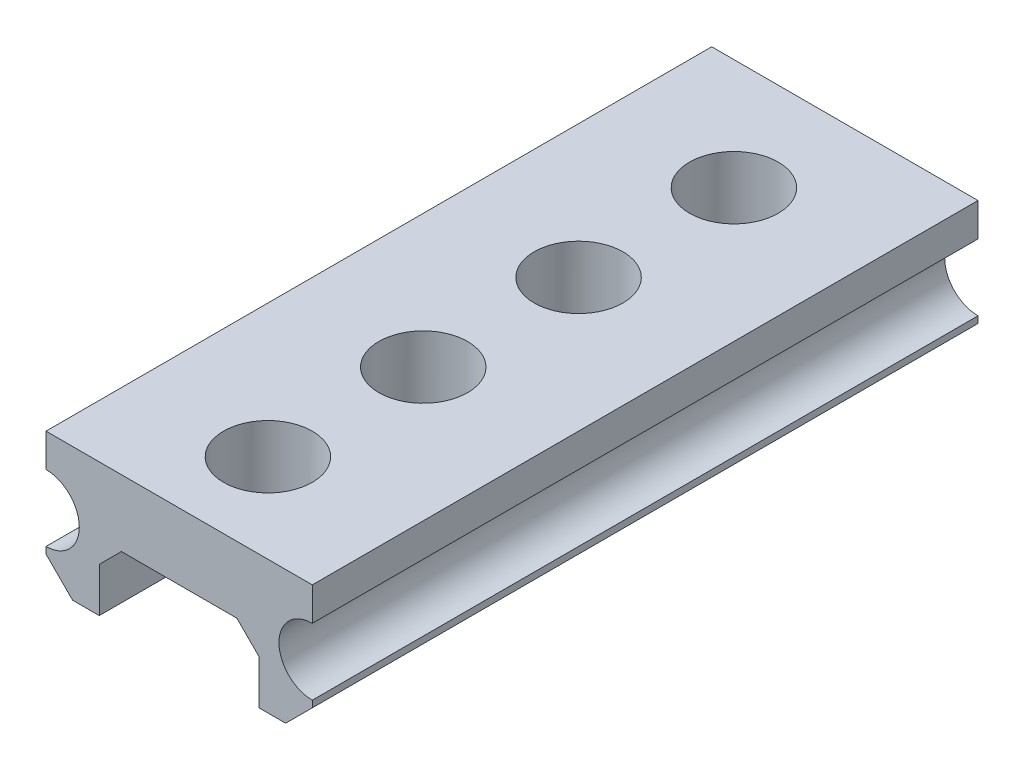
ISO-10303-21;
HEADER;
FILE_DESCRIPTION(('STEP AP214'),'2;1');
FILE_NAME('part.step','',(''),(''),'','','');
FILE_SCHEMA(('AUTOMOTIVE_DESIGN { 1 0 10303 214 1 1 1 1 }'));
ENDSEC;
DATA;
#1=APPLICATION_CONTEXT('core data for automotive mechanical design processes');
#2=APPLICATION_PROTOCOL_DEFINITION('international standard','automotive_design',2000,#1);
#3=PRODUCT_CONTEXT('',#1,'mechanical');
#4=PRODUCT('Part','Part','',(#3));
#5=PRODUCT_RELATED_PRODUCT_CATEGORY('part','',(#4));
#6=PRODUCT_DEFINITION_FORMATION('','',#4);
#7=PRODUCT_DEFINITION_CONTEXT('part definition',#1,'design');
#8=PRODUCT_DEFINITION('design','',#6,#7);
#9=PRODUCT_DEFINITION_SHAPE('','',#8);
#10=(LENGTH_UNIT() NAMED_UNIT(*) SI_UNIT(.MILLI.,.METRE.));
#11=(NAMED_UNIT(*) PLANE_ANGLE_UNIT() SI_UNIT($,.RADIAN.));
#12=(NAMED_UNIT(*) SI_UNIT($,.STERADIAN.) SOLID_ANGLE_UNIT());
#13=UNCERTAINTY_MEASURE_WITH_UNIT(LENGTH_MEASURE(1.E-05),#10,'distance_accuracy_value','');
#14=(GEOMETRIC_REPRESENTATION_CONTEXT(3) GLOBAL_UNCERTAINTY_ASSIGNED_CONTEXT((#13)) GLOBAL_UNIT_ASSIGNED_CONTEXT((#10,
#11,#12)) REPRESENTATION_CONTEXT('',''));
#15=CARTESIAN_POINT('',(0.,0.,0.));
#16=DIRECTION('',(0.,0.,1.));
#17=DIRECTION('',(1.,0.,0.));
#18=AXIS2_PLACEMENT_3D('',#15,#16,#17);
#19=CARTESIAN_POINT('',(-3.,-1.5,15.));
#20=DIRECTION('',(0.,1.,0.));
#21=DIRECTION('',(0.,0.,1.));
#22=AXIS2_PLACEMENT_3D('',#19,#20,#21);
#23=PLANE('',#22);
#24=DIRECTION('',(1.,0.,0.));
#25=VECTOR('',#24,1.);
#26=CARTESIAN_POINT('',(-3.,-1.5,15.));
#27=LINE('',#26,#25);
#28=CARTESIAN_POINT('',(1.8,-1.5,15.));
#29=VERTEX_POINT('',#28);
#30=CARTESIAN_POINT('',(2.4,-1.5,15.));
#31=VERTEX_POINT('',#30);
#32=EDGE_CURVE('E161',#29,#31,#27,.T.);
#33=ORIENTED_EDGE('',*,*,#32,.F.);
#34=DIRECTION('',(0.,0.,-1.));
#35=VECTOR('',#34,1.);
#36=CARTESIAN_POINT('',(1.8,-1.5,20.));
#37=LINE('',#36,#35);
#38=CARTESIAN_POINT('',(1.8,-1.5,0.));
#39=VERTEX_POINT('',#38);
#40=EDGE_CURVE('E148',#29,#39,#37,.T.);
#41=ORIENTED_EDGE('',*,*,#40,.T.);
#42=DIRECTION('',(1.,0.,0.));
#43=VECTOR('',#42,1.);
#44=CARTESIAN_POINT('',(-3.,-1.5,0.));
#45=LINE('',#44,#43);
#46=CARTESIAN_POINT('',(2.4,-1.5,0.));
#47=VERTEX_POINT('',#46);
#48=EDGE_CURVE('E159',#39,#47,#45,.T.);
#49=ORIENTED_EDGE('',*,*,#48,.T.);
#50=DIRECTION('',(0.,0.,1.));
#51=VECTOR('',#50,1.);
#52=CARTESIAN_POINT('',(2.4,-1.5,15.));
#53=LINE('',#52,#51);
#54=EDGE_CURVE('E191',#47,#31,#53,.T.);
#55=ORIENTED_EDGE('',*,*,#54,.T.);
#56=EDGE_LOOP('',(#33,#41,#49,#55));
#57=FACE_BOUND('',#56,.T.);
#58=ADVANCED_FACE('F32',(#57),#23,.F.);
#59=CARTESIAN_POINT('',(0.,-18.5,13.));
#60=DIRECTION('',(0.,1.,0.));
#61=DIRECTION('',(0.,0.,1.));
#62=AXIS2_PLACEMENT_3D('',#59,#60,#61);
#63=CYLINDRICAL_SURFACE('',#62,1.);
#64=CARTESIAN_POINT('',(0.,0.,13.));
#65=DIRECTION('',(0.,1.,0.));
#66=DIRECTION('',(-1.,0.,0.));
#67=AXIS2_PLACEMENT_3D('',#64,#65,#66);
#68=CIRCLE('',#67,1.);
#69=CARTESIAN_POINT('',(-1.,0.,13.));
#70=VERTEX_POINT('',#69);
#71=EDGE_CURVE('E256',#70,#70,#68,.F.);
#72=ORIENTED_EDGE('',*,*,#71,.T.);
#73=EDGE_LOOP('',(#72));
#74=FACE_BOUND('',#73,.T.);
#75=CARTESIAN_POINT('',(0.,1.5,13.));
#76=DIRECTION('',(0.,1.,0.));
#77=DIRECTION('',(0.,0.,1.));
#78=AXIS2_PLACEMENT_3D('',#75,#76,#77);
#79=CIRCLE('',#78,1.);
#80=CARTESIAN_POINT('',(0.,1.5,14.));
#81=VERTEX_POINT('',#80);
#82=EDGE_CURVE('E211',#81,#81,#79,.T.);
#83=ORIENTED_EDGE('',*,*,#82,.T.);
#84=EDGE_LOOP('',(#83));
#85=FACE_BOUND('',#84,.T.);
#86=ADVANCED_FACE('F323',(#74,#85),#63,.F.);
#87=CARTESIAN_POINT('',(0.,-18.5,9.5));
#88=DIRECTION('',(0.,1.,0.));
#89=DIRECTION('',(0.,0.,1.));
#90=AXIS2_PLACEMENT_3D('',#87,#88,#89);
#91=CYLINDRICAL_SURFACE('',#90,1.);
#92=CARTESIAN_POINT('',(0.,0.,9.5));
#93=DIRECTION('',(0.,1.,0.));
#94=DIRECTION('',(-1.,0.,0.));
#95=AXIS2_PLACEMENT_3D('',#92,#93,#94);
#96=CIRCLE('',#95,1.);
#97=CARTESIAN_POINT('',(-1.,0.,9.5));
#98=VERTEX_POINT('',#97);
#99=EDGE_CURVE('E253',#98,#98,#96,.F.);
#100=ORIENTED_EDGE('',*,*,#99,.T.);
#101=EDGE_LOOP('',(#100));
#102=FACE_BOUND('',#101,.T.);
#103=CARTESIAN_POINT('',(0.,1.5,9.5));
#104=DIRECTION('',(0.,1.,0.));
#105=DIRECTION('',(0.,0.,1.));
#106=AXIS2_PLACEMENT_3D('',#103,#104,#105);
#107=CIRCLE('',#106,1.);
#108=CARTESIAN_POINT('',(0.,1.5,10.5));
#109=VERTEX_POINT('',#108);
#110=EDGE_CURVE('E208',#109,#109,#107,.T.);
#111=ORIENTED_EDGE('',*,*,#110,.T.);
#112=EDGE_LOOP('',(#111));
#113=FACE_BOUND('',#112,.T.);
#114=ADVANCED_FACE('F328',(#102,#113),#91,.F.);
#115=CARTESIAN_POINT('',(3.,1.5,15.));
#116=DIRECTION('',(-1.,0.,0.));
#117=DIRECTION('',(0.,-1.,0.));
#118=AXIS2_PLACEMENT_3D('',#115,#116,#117);
#119=PLANE('',#118);
#120=DIRECTION('',(0.,1.,0.));
#121=VECTOR('',#120,1.);
#122=CARTESIAN_POINT('',(3.,1.5,15.));
#123=LINE('',#122,#121);
#124=CARTESIAN_POINT('',(3.,-0.900000000000004,15.));
#125=VERTEX_POINT('',#124);
#126=CARTESIAN_POINT('',(3.,-0.75,15.));
#127=VERTEX_POINT('',#126);
#128=EDGE_CURVE('E283',#125,#127,#123,.T.);
#129=ORIENTED_EDGE('',*,*,#128,.F.);
#130=DIRECTION('',(0.,0.,-1.));
#131=VECTOR('',#130,1.);
#132=CARTESIAN_POINT('',(3.,-0.900000000000004,15.));
#133=LINE('',#132,#131);
#134=CARTESIAN_POINT('',(3.,-0.900000000000004,0.));
#135=VERTEX_POINT('',#134);
#136=EDGE_CURVE('E205',#125,#135,#133,.T.);
#137=ORIENTED_EDGE('',*,*,#136,.T.);
#138=DIRECTION('',(0.,1.,0.));
#139=VECTOR('',#138,1.);
#140=CARTESIAN_POINT('',(3.,1.5,0.));
#141=LINE('',#140,#139);
#142=CARTESIAN_POINT('',(3.,-0.75,0.));
#143=VERTEX_POINT('',#142);
#144=EDGE_CURVE('E293',#135,#143,#141,.T.);
#145=ORIENTED_EDGE('',*,*,#144,.T.);
#146=DIRECTION('',(0.,0.,1.));
#147=VECTOR('',#146,1.);
#148=CARTESIAN_POINT('',(3.,-0.75,-5.));
#149=LINE('',#148,#147);
#150=EDGE_CURVE('E279',#143,#127,#149,.T.);
#151=ORIENTED_EDGE('',*,*,#150,.T.);
#152=EDGE_LOOP('',(#129,#137,#145,#151));
#153=FACE_BOUND('',#152,.T.);
#154=ADVANCED_FACE('F348',(#153),#119,.F.);
#155=CARTESIAN_POINT('',(-3.,1.5,15.));
#156=DIRECTION('',(1.,0.,0.));
#157=DIRECTION('',(0.,0.,-1.));
#158=AXIS2_PLACEMENT_3D('',#155,#156,#157);
#159=PLANE('',#158);
#160=DIRECTION('',(0.,-1.,0.));
#161=VECTOR('',#160,1.);
#162=CARTESIAN_POINT('',(-3.,1.5,0.));
#163=LINE('',#162,#161);
#164=CARTESIAN_POINT('',(-3.,1.5,0.));
#165=VERTEX_POINT('',#164);
#166=CARTESIAN_POINT('',(-3.,0.75,0.));
#167=VERTEX_POINT('',#166);
#168=EDGE_CURVE('E169',#165,#167,#163,.T.);
#169=ORIENTED_EDGE('',*,*,#168,.T.);
#170=DIRECTION('',(0.,0.,1.));
#171=VECTOR('',#170,1.);
#172=CARTESIAN_POINT('',(-3.,0.75,-5.));
#173=LINE('',#172,#171);
#174=CARTESIAN_POINT('',(-3.,0.75,15.));
#175=VERTEX_POINT('',#174);
#176=EDGE_CURVE('E273',#167,#175,#173,.T.);
#177=ORIENTED_EDGE('',*,*,#176,.T.);
#178=DIRECTION('',(0.,-1.,0.));
#179=VECTOR('',#178,1.);
#180=CARTESIAN_POINT('',(-3.,1.5,15.));
#181=LINE('',#180,#179);
#182=CARTESIAN_POINT('',(-3.,1.5,15.));
#183=VERTEX_POINT('',#182);
#184=EDGE_CURVE('E288',#183,#175,#181,.T.);
#185=ORIENTED_EDGE('',*,*,#184,.F.);
#186=DIRECTION('',(0.,0.,-1.));
#187=VECTOR('',#186,1.);
#188=CARTESIAN_POINT('',(-3.,1.5,15.));
#189=LINE('',#188,#187);
#190=EDGE_CURVE('E178',#183,#165,#189,.T.);
#191=ORIENTED_EDGE('',*,*,#190,.T.);
#192=EDGE_LOOP('',(#169,#177,#185,#191));
#193=FACE_BOUND('',#192,.T.);
#194=ADVANCED_FACE('F340',(#193),#159,.F.);
#195=CARTESIAN_POINT('',(3.,0.75,15.));
#196=VERTEX_POINT('',#195);
#197=CARTESIAN_POINT('',(3.,1.5,15.));
#198=VERTEX_POINT('',#197);
#199=EDGE_CURVE('E172',#196,#198,#123,.T.);
#200=ORIENTED_EDGE('',*,*,#199,.F.);
#201=DIRECTION('',(0.,0.,1.));
#202=VECTOR('',#201,1.);
#203=CARTESIAN_POINT('',(3.,0.75,-5.));
#204=LINE('',#203,#202);
#205=CARTESIAN_POINT('',(3.,0.75,0.));
#206=VERTEX_POINT('',#205);
#207=EDGE_CURVE('E276',#196,#206,#204,.F.);
#208=ORIENTED_EDGE('',*,*,#207,.T.);
#209=CARTESIAN_POINT('',(3.,1.5,0.));
#210=VERTEX_POINT('',#209);
#211=EDGE_CURVE('E282',#206,#210,#141,.T.);
#212=ORIENTED_EDGE('',*,*,#211,.T.);
#213=DIRECTION('',(0.,0.,-1.));
#214=VECTOR('',#213,1.);
#215=CARTESIAN_POINT('',(3.,1.5,15.));
#216=LINE('',#215,#214);
#217=EDGE_CURVE('E181',#198,#210,#216,.T.);
#218=ORIENTED_EDGE('',*,*,#217,.F.);
#219=EDGE_LOOP('',(#200,#208,#212,#218));
#220=FACE_BOUND('',#219,.T.);
#221=ADVANCED_FACE('F344',(#220),#119,.F.);
#222=CARTESIAN_POINT('',(-3.,1.5,15.));
#223=DIRECTION('',(0.,-1.,0.));
#224=DIRECTION('',(0.,0.,-1.));
#225=AXIS2_PLACEMENT_3D('',#222,#223,#224);
#226=PLANE('',#225);
#227=CARTESIAN_POINT('',(0.,1.5,6.));
#228=DIRECTION('',(0.,1.,0.));
#229=DIRECTION('',(0.,0.,1.));
#230=AXIS2_PLACEMENT_3D('',#227,#228,#229);
#231=CIRCLE('',#230,1.);
#232=CARTESIAN_POINT('',(0.,1.5,7.));
#233=VERTEX_POINT('',#232);
#234=EDGE_CURVE('E236',#233,#233,#231,.T.);
#235=ORIENTED_EDGE('',*,*,#234,.F.);
#236=EDGE_LOOP('',(#235));
#237=FACE_BOUND('',#236,.T.);
#238=CARTESIAN_POINT('',(0.,1.5,2.5));
#239=DIRECTION('',(0.,1.,0.));
#240=DIRECTION('',(0.,0.,1.));
#241=AXIS2_PLACEMENT_3D('',#238,#239,#240);
#242=CIRCLE('',#241,1.);
#243=CARTESIAN_POINT('',(0.,1.5,3.5));
#244=VERTEX_POINT('',#243);
#245=EDGE_CURVE('E262',#244,#244,#242,.T.);
#246=ORIENTED_EDGE('',*,*,#245,.F.);
#247=EDGE_LOOP('',(#246));
#248=FACE_BOUND('',#247,.T.);
#249=DIRECTION('',(-1.,0.,0.));
#250=VECTOR('',#249,1.);
#251=CARTESIAN_POINT('',(-3.,1.5,0.));
#252=LINE('',#251,#250);
#253=EDGE_CURVE('E294',#210,#165,#252,.T.);
#254=ORIENTED_EDGE('',*,*,#253,.T.);
#255=ORIENTED_EDGE('',*,*,#190,.F.);
#256=DIRECTION('',(-1.,0.,0.));
#257=VECTOR('',#256,1.);
#258=CARTESIAN_POINT('',(-3.,1.5,15.));
#259=LINE('',#258,#257);
#260=EDGE_CURVE('E285',#198,#183,#259,.T.);
#261=ORIENTED_EDGE('',*,*,#260,.F.);
#262=ORIENTED_EDGE('',*,*,#217,.T.);
#263=EDGE_LOOP('',(#254,#255,#261,#262));
#264=FACE_BOUND('',#263,.T.);
#265=ORIENTED_EDGE('',*,*,#110,.F.);
#266=EDGE_LOOP('',(#265));
#267=FACE_BOUND('',#266,.T.);
#268=ORIENTED_EDGE('',*,*,#82,.F.);
#269=EDGE_LOOP('',(#268));
#270=FACE_BOUND('',#269,.T.);
#271=ADVANCED_FACE('F339',(#237,#248,#264,#267,#270),#226,.F.);
#272=CARTESIAN_POINT('',(-3.,-0.75,0.));
#273=VERTEX_POINT('',#272);
#274=CARTESIAN_POINT('',(-3.,-0.899999999999995,0.));
#275=VERTEX_POINT('',#274);
#276=EDGE_CURVE('E174',#273,#275,#163,.T.);
#277=ORIENTED_EDGE('',*,*,#276,.T.);
#278=DIRECTION('',(0.,0.,1.));
#279=VECTOR('',#278,1.);
#280=CARTESIAN_POINT('',(-3.,-0.899999999999995,15.));
#281=LINE('',#280,#279);
#282=CARTESIAN_POINT('',(-3.,-0.899999999999995,15.));
#283=VERTEX_POINT('',#282);
#284=EDGE_CURVE('E199',#275,#283,#281,.T.);
#285=ORIENTED_EDGE('',*,*,#284,.T.);
#286=CARTESIAN_POINT('',(-3.,-0.75,15.));
#287=VERTEX_POINT('',#286);
#288=EDGE_CURVE('E287',#287,#283,#181,.T.);
#289=ORIENTED_EDGE('',*,*,#288,.F.);
#290=DIRECTION('',(0.,0.,1.));
#291=VECTOR('',#290,1.);
#292=CARTESIAN_POINT('',(-3.,-0.75,-5.));
#293=LINE('',#292,#291);
#294=EDGE_CURVE('E269',#287,#273,#293,.F.);
#295=ORIENTED_EDGE('',*,*,#294,.T.);
#296=EDGE_LOOP('',(#277,#285,#289,#295));
#297=FACE_BOUND('',#296,.T.);
#298=ADVANCED_FACE('F302',(#297),#159,.F.);
#299=CARTESIAN_POINT('',(-2.4,-1.5,0.));
#300=VERTEX_POINT('',#299);
#301=CARTESIAN_POINT('',(-1.8,-1.5,0.));
#302=VERTEX_POINT('',#301);
#303=EDGE_CURVE('E168',#300,#302,#45,.T.);
#304=ORIENTED_EDGE('',*,*,#303,.T.);
#305=DIRECTION('',(0.,0.,-1.));
#306=VECTOR('',#305,1.);
#307=CARTESIAN_POINT('',(-1.8,-1.5,20.));
#308=LINE('',#307,#306);
#309=CARTESIAN_POINT('',(-1.8,-1.5,15.));
#310=VERTEX_POINT('',#309);
#311=EDGE_CURVE('E153',#310,#302,#308,.T.);
#312=ORIENTED_EDGE('',*,*,#311,.F.);
#313=CARTESIAN_POINT('',(-2.4,-1.5,15.));
#314=VERTEX_POINT('',#313);
#315=EDGE_CURVE('E182',#314,#310,#27,.T.);
#316=ORIENTED_EDGE('',*,*,#315,.F.);
#317=DIRECTION('',(0.,0.,-1.));
#318=VECTOR('',#317,1.);
#319=CARTESIAN_POINT('',(-2.4,-1.5,15.));
#320=LINE('',#319,#318);
#321=EDGE_CURVE('E193',#314,#300,#320,.T.);
#322=ORIENTED_EDGE('',*,*,#321,.T.);
#323=EDGE_LOOP('',(#304,#312,#316,#322));
#324=FACE_BOUND('',#323,.T.);
#325=ADVANCED_FACE('F313',(#324),#23,.F.);
#326=CARTESIAN_POINT('',(0.,0.,15.));
#327=DIRECTION('',(0.,0.,1.));
#328=DIRECTION('',(1.,0.,0.));
#329=AXIS2_PLACEMENT_3D('',#326,#327,#328);
#330=PLANE('',#329);
#331=DIRECTION('',(0.,1.,0.));
#332=VECTOR('',#331,1.);
#333=CARTESIAN_POINT('',(1.8,0.,15.));
#334=LINE('',#333,#332);
#335=CARTESIAN_POINT('',(1.8,-0.500000000000005,15.));
#336=VERTEX_POINT('',#335);
#337=EDGE_CURVE('E231',#29,#336,#334,.T.);
#338=ORIENTED_EDGE('',*,*,#337,.F.);
#339=ORIENTED_EDGE('',*,*,#32,.T.);
#340=DIRECTION('',(-0.70710678118655,-0.707106781186545,0.));
#341=VECTOR('',#340,1.);
#342=CARTESIAN_POINT('',(1.94999999999999,-1.95000000000001,15.));
#343=LINE('',#342,#341);
#344=EDGE_CURVE('E201',#31,#125,#343,.F.);
#345=ORIENTED_EDGE('',*,*,#344,.T.);
#346=ORIENTED_EDGE('',*,*,#128,.T.);
#347=CARTESIAN_POINT('',(3.,0.,15.));
#348=DIRECTION('',(0.,0.,1.));
#349=DIRECTION('',(1.,0.,0.));
#350=AXIS2_PLACEMENT_3D('',#347,#348,#349);
#351=CIRCLE('',#350,0.75);
#352=EDGE_CURVE('E266',#196,#127,#351,.T.);
#353=ORIENTED_EDGE('',*,*,#352,.F.);
#354=ORIENTED_EDGE('',*,*,#199,.T.);
#355=ORIENTED_EDGE('',*,*,#260,.T.);
#356=ORIENTED_EDGE('',*,*,#184,.T.);
#357=CARTESIAN_POINT('',(-3.,0.,15.));
#358=DIRECTION('',(0.,0.,1.));
#359=DIRECTION('',(1.,0.,0.));
#360=AXIS2_PLACEMENT_3D('',#357,#358,#359);
#361=CIRCLE('',#360,0.75);
#362=EDGE_CURVE('E265',#287,#175,#361,.T.);
#363=ORIENTED_EDGE('',*,*,#362,.F.);
#364=ORIENTED_EDGE('',*,*,#288,.T.);
#365=DIRECTION('',(-0.707106781186546,0.70710678118655,0.));
#366=VECTOR('',#365,1.);
#367=CARTESIAN_POINT('',(-1.95000000000001,-1.95,15.));
#368=LINE('',#367,#366);
#369=EDGE_CURVE('E203',#283,#314,#368,.F.);
#370=ORIENTED_EDGE('',*,*,#369,.T.);
#371=ORIENTED_EDGE('',*,*,#315,.T.);
#372=DIRECTION('',(0.,-1.,0.));
#373=VECTOR('',#372,1.);
#374=CARTESIAN_POINT('',(-1.8,0.,15.));
#375=LINE('',#374,#373);
#376=CARTESIAN_POINT('',(-1.8,-0.500000000000001,15.));
#377=VERTEX_POINT('',#376);
#378=EDGE_CURVE('E237',#377,#310,#375,.T.);
#379=ORIENTED_EDGE('',*,*,#378,.F.);
#380=DIRECTION('',(-0.707106781186551,-0.707106781186544,0.));
#381=VECTOR('',#380,1.);
#382=CARTESIAN_POINT('',(-1.29999999999999,0.,15.));
#383=LINE('',#382,#381);
#384=CARTESIAN_POINT('',(-1.29999999999999,0.,15.));
#385=VERTEX_POINT('',#384);
#386=EDGE_CURVE('E11',#377,#385,#383,.F.);
#387=ORIENTED_EDGE('',*,*,#386,.T.);
#388=DIRECTION('',(-1.,0.,0.));
#389=VECTOR('',#388,1.);
#390=CARTESIAN_POINT('',(0.,0.,15.));
#391=LINE('',#390,#389);
#392=CARTESIAN_POINT('',(1.3,0.,15.));
#393=VERTEX_POINT('',#392);
#394=EDGE_CURVE('E233',#393,#385,#391,.T.);
#395=ORIENTED_EDGE('',*,*,#394,.F.);
#396=DIRECTION('',(-0.707106781186544,0.707106781186551,0.));
#397=VECTOR('',#396,1.);
#398=CARTESIAN_POINT('',(1.8,-0.500000000000005,15.));
#399=LINE('',#398,#397);
#400=EDGE_CURVE('E226',#393,#336,#399,.F.);
#401=ORIENTED_EDGE('',*,*,#400,.T.);
#402=EDGE_LOOP('',(#338,#339,#345,#346,#353,#354,#355,#356,#363,#364,#370,#371,#379,#387,#395,#401));
#403=FACE_BOUND('',#402,.T.);
#404=ADVANCED_FACE('F230',(#403),#330,.T.);
#405=CARTESIAN_POINT('',(0.,0.,0.));
#406=DIRECTION('',(0.,0.,1.));
#407=DIRECTION('',(1.,0.,0.));
#408=AXIS2_PLACEMENT_3D('',#405,#406,#407);
#409=PLANE('',#408);
#410=ORIENTED_EDGE('',*,*,#48,.F.);
#411=DIRECTION('',(0.,-1.,0.));
#412=VECTOR('',#411,1.);
#413=CARTESIAN_POINT('',(1.8,0.,0.));
#414=LINE('',#413,#412);
#415=CARTESIAN_POINT('',(1.8,-0.500000000000005,0.));
#416=VERTEX_POINT('',#415);
#417=EDGE_CURVE('E144',#416,#39,#414,.T.);
#418=ORIENTED_EDGE('',*,*,#417,.F.);
#419=DIRECTION('',(0.707106781186544,-0.707106781186551,0.));
#420=VECTOR('',#419,1.);
#421=CARTESIAN_POINT('',(0.650000000000007,0.65,0.));
#422=LINE('',#421,#420);
#423=CARTESIAN_POINT('',(1.3,0.,0.));
#424=VERTEX_POINT('',#423);
#425=EDGE_CURVE('E224',#416,#424,#422,.F.);
#426=ORIENTED_EDGE('',*,*,#425,.T.);
#427=DIRECTION('',(1.,0.,0.));
#428=VECTOR('',#427,1.);
#429=CARTESIAN_POINT('',(-1.8,0.,0.));
#430=LINE('',#429,#428);
#431=CARTESIAN_POINT('',(-1.29999999999999,0.,0.));
#432=VERTEX_POINT('',#431);
#433=EDGE_CURVE('E154',#432,#424,#430,.T.);
#434=ORIENTED_EDGE('',*,*,#433,.F.);
#435=DIRECTION('',(0.707106781186551,0.707106781186544,0.));
#436=VECTOR('',#435,1.);
#437=CARTESIAN_POINT('',(-0.64999999999999,0.649999999999997,0.));
#438=LINE('',#437,#436);
#439=CARTESIAN_POINT('',(-1.8,-0.500000000000001,0.));
#440=VERTEX_POINT('',#439);
#441=EDGE_CURVE('E40',#432,#440,#438,.F.);
#442=ORIENTED_EDGE('',*,*,#441,.T.);
#443=DIRECTION('',(0.,1.,0.));
#444=VECTOR('',#443,1.);
#445=CARTESIAN_POINT('',(-1.8,-1.5,0.));
#446=LINE('',#445,#444);
#447=EDGE_CURVE('E245',#302,#440,#446,.T.);
#448=ORIENTED_EDGE('',*,*,#447,.F.);
#449=ORIENTED_EDGE('',*,*,#303,.F.);
#450=DIRECTION('',(0.707106781186546,-0.70710678118655,0.));
#451=VECTOR('',#450,1.);
#452=CARTESIAN_POINT('',(-2.4,-1.5,0.));
#453=LINE('',#452,#451);
#454=EDGE_CURVE('E197',#300,#275,#453,.F.);
#455=ORIENTED_EDGE('',*,*,#454,.T.);
#456=ORIENTED_EDGE('',*,*,#276,.F.);
#457=CARTESIAN_POINT('',(-3.,0.,0.));
#458=DIRECTION('',(0.,0.,1.));
#459=DIRECTION('',(1.,0.,0.));
#460=AXIS2_PLACEMENT_3D('',#457,#458,#459);
#461=CIRCLE('',#460,0.75);
#462=EDGE_CURVE('E185',#273,#167,#461,.T.);
#463=ORIENTED_EDGE('',*,*,#462,.T.);
#464=ORIENTED_EDGE('',*,*,#168,.F.);
#465=ORIENTED_EDGE('',*,*,#253,.F.);
#466=ORIENTED_EDGE('',*,*,#211,.F.);
#467=CARTESIAN_POINT('',(3.,0.,0.));
#468=DIRECTION('',(0.,0.,1.));
#469=DIRECTION('',(1.,0.,0.));
#470=AXIS2_PLACEMENT_3D('',#467,#468,#469);
#471=CIRCLE('',#470,0.75);
#472=EDGE_CURVE('E188',#206,#143,#471,.T.);
#473=ORIENTED_EDGE('',*,*,#472,.T.);
#474=ORIENTED_EDGE('',*,*,#144,.F.);
#475=DIRECTION('',(0.70710678118655,0.707106781186545,0.));
#476=VECTOR('',#475,1.);
#477=CARTESIAN_POINT('',(3.,-0.900000000000004,0.));
#478=LINE('',#477,#476);
#479=EDGE_CURVE('E166',#135,#47,#478,.F.);
#480=ORIENTED_EDGE('',*,*,#479,.T.);
#481=EDGE_LOOP('',(#410,#418,#426,#434,#442,#448,#449,#455,#456,#463,#464,#465,#466,#473,#474,#480));
#482=FACE_BOUND('',#481,.T.);
#483=ADVANCED_FACE('F164',(#482),#409,.F.);
#484=CARTESIAN_POINT('',(-3.,0.,-5.));
#485=DIRECTION('',(0.,0.,1.));
#486=DIRECTION('',(1.,0.,0.));
#487=AXIS2_PLACEMENT_3D('',#484,#485,#486);
#488=CYLINDRICAL_SURFACE('',#487,0.75);
#489=ORIENTED_EDGE('',*,*,#462,.F.);
#490=ORIENTED_EDGE('',*,*,#294,.F.);
#491=ORIENTED_EDGE('',*,*,#362,.T.);
#492=ORIENTED_EDGE('',*,*,#176,.F.);
#493=EDGE_LOOP('',(#489,#490,#491,#492));
#494=FACE_BOUND('',#493,.T.);
#495=ADVANCED_FACE('F361',(#494),#488,.F.);
#496=CARTESIAN_POINT('',(3.,0.,-5.));
#497=DIRECTION('',(0.,0.,1.));
#498=DIRECTION('',(1.,0.,0.));
#499=AXIS2_PLACEMENT_3D('',#496,#497,#498);
#500=CYLINDRICAL_SURFACE('',#499,0.75);
#501=ORIENTED_EDGE('',*,*,#472,.F.);
#502=ORIENTED_EDGE('',*,*,#207,.F.);
#503=ORIENTED_EDGE('',*,*,#352,.T.);
#504=ORIENTED_EDGE('',*,*,#150,.F.);
#505=EDGE_LOOP('',(#501,#502,#503,#504));
#506=FACE_BOUND('',#505,.T.);
#507=ADVANCED_FACE('F384',(#506),#500,.F.);
#508=CARTESIAN_POINT('',(-2.4,-1.5,15.));
#509=DIRECTION('',(0.70710678118655,0.707106781186546,0.));
#510=DIRECTION('',(0.,0.,-1.));
#511=AXIS2_PLACEMENT_3D('',#508,#509,#510);
#512=PLANE('',#511);
#513=ORIENTED_EDGE('',*,*,#369,.F.);
#514=ORIENTED_EDGE('',*,*,#284,.F.);
#515=ORIENTED_EDGE('',*,*,#454,.F.);
#516=ORIENTED_EDGE('',*,*,#321,.F.);
#517=EDGE_LOOP('',(#513,#514,#515,#516));
#518=FACE_BOUND('',#517,.T.);
#519=ADVANCED_FACE('F307',(#518),#512,.F.);
#520=CARTESIAN_POINT('',(3.,-0.900000000000004,15.));
#521=DIRECTION('',(-0.707106781186545,0.70710678118655,0.));
#522=DIRECTION('',(0.,0.,-1.));
#523=AXIS2_PLACEMENT_3D('',#520,#521,#522);
#524=PLANE('',#523);
#525=ORIENTED_EDGE('',*,*,#344,.F.);
#526=ORIENTED_EDGE('',*,*,#54,.F.);
#527=ORIENTED_EDGE('',*,*,#479,.F.);
#528=ORIENTED_EDGE('',*,*,#136,.F.);
#529=EDGE_LOOP('',(#525,#526,#527,#528));
#530=FACE_BOUND('',#529,.T.);
#531=ADVANCED_FACE('F378',(#530),#524,.F.);
#532=CARTESIAN_POINT('',(0.,-18.5,2.5));
#533=DIRECTION('',(0.,1.,0.));
#534=DIRECTION('',(0.,0.,1.));
#535=AXIS2_PLACEMENT_3D('',#532,#533,#534);
#536=CYLINDRICAL_SURFACE('',#535,1.);
#537=CARTESIAN_POINT('',(0.,0.,2.5));
#538=DIRECTION('',(0.,1.,0.));
#539=DIRECTION('',(-1.,0.,0.));
#540=AXIS2_PLACEMENT_3D('',#537,#538,#539);
#541=CIRCLE('',#540,1.);
#542=CARTESIAN_POINT('',(-1.,0.,2.5));
#543=VERTEX_POINT('',#542);
#544=EDGE_CURVE('E216',#543,#543,#541,.F.);
#545=ORIENTED_EDGE('',*,*,#544,.T.);
#546=EDGE_LOOP('',(#545));
#547=FACE_BOUND('',#546,.T.);
#548=ORIENTED_EDGE('',*,*,#245,.T.);
#549=EDGE_LOOP('',(#548));
#550=FACE_BOUND('',#549,.T.);
#551=ADVANCED_FACE('F381',(#547,#550),#536,.F.);
#552=CARTESIAN_POINT('',(0.,-18.5,6.));
#553=DIRECTION('',(0.,1.,0.));
#554=DIRECTION('',(0.,0.,1.));
#555=AXIS2_PLACEMENT_3D('',#552,#553,#554);
#556=CYLINDRICAL_SURFACE('',#555,1.);
#557=CARTESIAN_POINT('',(0.,0.,6.));
#558=DIRECTION('',(0.,1.,0.));
#559=DIRECTION('',(-1.,0.,0.));
#560=AXIS2_PLACEMENT_3D('',#557,#558,#559);
#561=CIRCLE('',#560,1.);
#562=CARTESIAN_POINT('',(-1.,0.,6.));
#563=VERTEX_POINT('',#562);
#564=EDGE_CURVE('E162',#563,#563,#561,.F.);
#565=ORIENTED_EDGE('',*,*,#564,.T.);
#566=EDGE_LOOP('',(#565));
#567=FACE_BOUND('',#566,.T.);
#568=ORIENTED_EDGE('',*,*,#234,.T.);
#569=EDGE_LOOP('',(#568));
#570=FACE_BOUND('',#569,.T.);
#571=ADVANCED_FACE('F470',(#567,#570),#556,.F.);
#572=CARTESIAN_POINT('',(-1.8,0.,20.));
#573=DIRECTION('',(0.,1.,0.));
#574=DIRECTION('',(-1.,0.,0.));
#575=AXIS2_PLACEMENT_3D('',#572,#573,#574);
#576=PLANE('',#575);
#577=ORIENTED_EDGE('',*,*,#99,.F.);
#578=EDGE_LOOP('',(#577));
#579=FACE_BOUND('',#578,.T.);
#580=ORIENTED_EDGE('',*,*,#433,.T.);
#581=DIRECTION('',(0.,0.,1.));
#582=VECTOR('',#581,1.);
#583=CARTESIAN_POINT('',(1.3,0.,15.));
#584=LINE('',#583,#582);
#585=EDGE_CURVE('E221',#424,#393,#584,.T.);
#586=ORIENTED_EDGE('',*,*,#585,.T.);
#587=ORIENTED_EDGE('',*,*,#394,.T.);
#588=DIRECTION('',(0.,0.,-1.));
#589=VECTOR('',#588,1.);
#590=CARTESIAN_POINT('',(-1.29999999999999,0.,0.));
#591=LINE('',#590,#589);
#592=EDGE_CURVE('E218',#385,#432,#591,.T.);
#593=ORIENTED_EDGE('',*,*,#592,.T.);
#594=EDGE_LOOP('',(#580,#586,#587,#593));
#595=FACE_BOUND('',#594,.T.);
#596=ORIENTED_EDGE('',*,*,#564,.F.);
#597=EDGE_LOOP('',(#596));
#598=FACE_BOUND('',#597,.T.);
#599=ORIENTED_EDGE('',*,*,#544,.F.);
#600=EDGE_LOOP('',(#599));
#601=FACE_BOUND('',#600,.T.);
#602=ORIENTED_EDGE('',*,*,#71,.F.);
#603=EDGE_LOOP('',(#602));
#604=FACE_BOUND('',#603,.T.);
#605=ADVANCED_FACE('F242',(#579,#595,#598,#601,#604),#576,.F.);
#606=CARTESIAN_POINT('',(1.8,0.,20.));
#607=DIRECTION('',(1.,0.,0.));
#608=DIRECTION('',(0.,1.,0.));
#609=AXIS2_PLACEMENT_3D('',#606,#607,#608);
#610=PLANE('',#609);
#611=ORIENTED_EDGE('',*,*,#337,.T.);
#612=DIRECTION('',(0.,0.,-1.));
#613=VECTOR('',#612,1.);
#614=CARTESIAN_POINT('',(1.8,-0.500000000000005,0.));
#615=LINE('',#614,#613);
#616=EDGE_CURVE('E151',#336,#416,#615,.T.);
#617=ORIENTED_EDGE('',*,*,#616,.T.);
#618=ORIENTED_EDGE('',*,*,#417,.T.);
#619=ORIENTED_EDGE('',*,*,#40,.F.);
#620=EDGE_LOOP('',(#611,#617,#618,#619));
#621=FACE_BOUND('',#620,.T.);
#622=ADVANCED_FACE('F147',(#621),#610,.F.);
#623=CARTESIAN_POINT('',(-1.8,-1.5,20.));
#624=DIRECTION('',(-1.,0.,0.));
#625=DIRECTION('',(0.,-1.,0.));
#626=AXIS2_PLACEMENT_3D('',#623,#624,#625);
#627=PLANE('',#626);
#628=ORIENTED_EDGE('',*,*,#447,.T.);
#629=DIRECTION('',(0.,0.,1.));
#630=VECTOR('',#629,1.);
#631=CARTESIAN_POINT('',(-1.8,-0.500000000000001,15.));
#632=LINE('',#631,#630);
#633=EDGE_CURVE('E53',#440,#377,#632,.T.);
#634=ORIENTED_EDGE('',*,*,#633,.T.);
#635=ORIENTED_EDGE('',*,*,#378,.T.);
#636=ORIENTED_EDGE('',*,*,#311,.T.);
#637=EDGE_LOOP('',(#628,#634,#635,#636));
#638=FACE_BOUND('',#637,.T.);
#639=ADVANCED_FACE('F315',(#638),#627,.F.);
#640=CARTESIAN_POINT('',(1.8,-0.500000000000005,20.));
#641=DIRECTION('',(-0.707106781186551,-0.707106781186544,0.));
#642=DIRECTION('',(0.,0.,1.));
#643=AXIS2_PLACEMENT_3D('',#640,#641,#642);
#644=PLANE('',#643);
#645=ORIENTED_EDGE('',*,*,#400,.F.);
#646=ORIENTED_EDGE('',*,*,#585,.F.);
#647=ORIENTED_EDGE('',*,*,#425,.F.);
#648=ORIENTED_EDGE('',*,*,#616,.F.);
#649=EDGE_LOOP('',(#645,#646,#647,#648));
#650=FACE_BOUND('',#649,.T.);
#651=ADVANCED_FACE('F239',(#650),#644,.T.);
#652=CARTESIAN_POINT('',(-1.29999999999999,0.,20.));
#653=DIRECTION('',(0.707106781186544,-0.707106781186551,0.));
#654=DIRECTION('',(0.,0.,1.));
#655=AXIS2_PLACEMENT_3D('',#652,#653,#654);
#656=PLANE('',#655);
#657=ORIENTED_EDGE('',*,*,#386,.F.);
#658=ORIENTED_EDGE('',*,*,#633,.F.);
#659=ORIENTED_EDGE('',*,*,#441,.F.);
#660=ORIENTED_EDGE('',*,*,#592,.F.);
#661=EDGE_LOOP('',(#657,#658,#659,#660));
#662=FACE_BOUND('',#661,.T.);
#663=ADVANCED_FACE('F34',(#662),#656,.T.);
#664=CLOSED_SHELL('',(#58,#86,#114,#154,#194,#221,#271,#298,#325,#404,#483,#495,#507,#519,#531,
#551,#571,#605,#622,#639,#651,#663));
#665=MANIFOLD_SOLID_BREP('B2',#664);
#666=ADVANCED_BREP_SHAPE_REPRESENTATION('',(#18,#665),#14);
#667=SHAPE_DEFINITION_REPRESENTATION(#9,#666);
ENDSEC;
END-ISO-10303-21;
